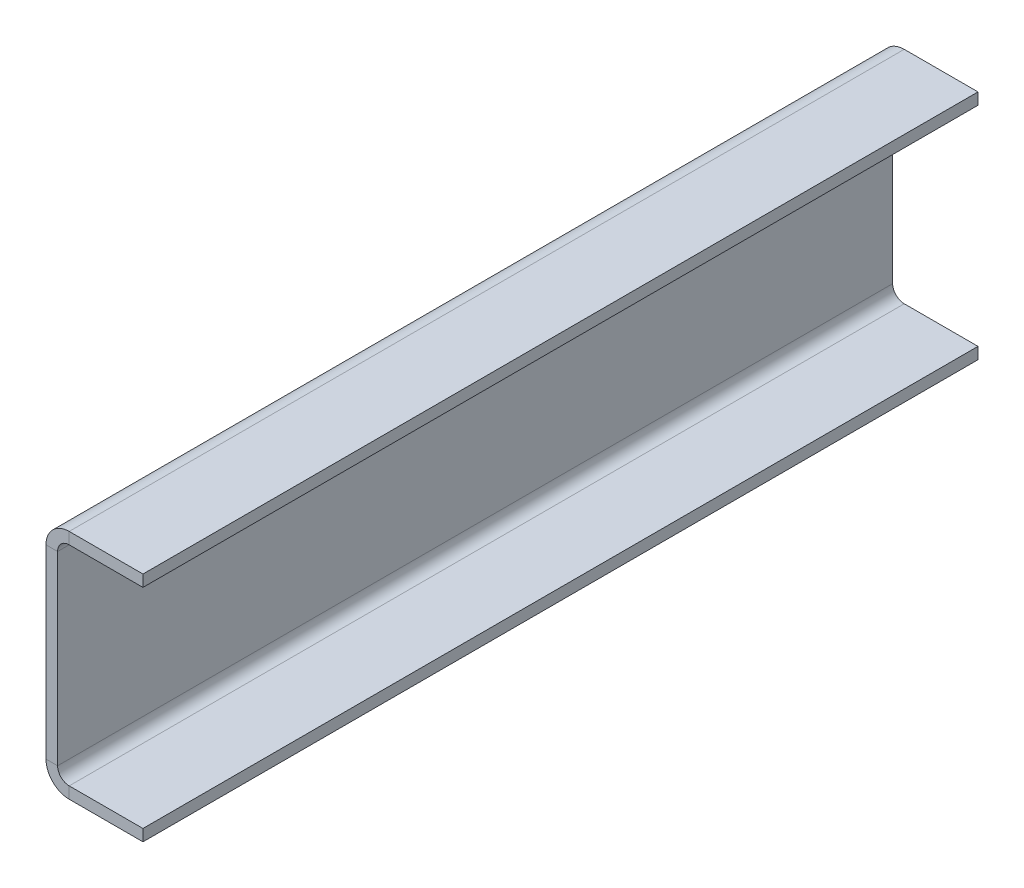
ISO-10303-21;
HEADER;
FILE_DESCRIPTION(('STEP AP214'),'2;1');
FILE_NAME('part.step','',(''),(''),'','','');
FILE_SCHEMA(('AUTOMOTIVE_DESIGN { 1 0 10303 214 1 1 1 1 }'));
ENDSEC;
DATA;
#1=APPLICATION_CONTEXT('core data for automotive mechanical design processes');
#2=APPLICATION_PROTOCOL_DEFINITION('international standard','automotive_design',2000,#1);
#3=PRODUCT_CONTEXT('',#1,'mechanical');
#4=PRODUCT('Part','Part','',(#3));
#5=PRODUCT_RELATED_PRODUCT_CATEGORY('part','',(#4));
#6=PRODUCT_DEFINITION_FORMATION('','',#4);
#7=PRODUCT_DEFINITION_CONTEXT('part definition',#1,'design');
#8=PRODUCT_DEFINITION('design','',#6,#7);
#9=PRODUCT_DEFINITION_SHAPE('','',#8);
#10=(LENGTH_UNIT() NAMED_UNIT(*) SI_UNIT(.MILLI.,.METRE.));
#11=(NAMED_UNIT(*) PLANE_ANGLE_UNIT() SI_UNIT($,.RADIAN.));
#12=(NAMED_UNIT(*) SI_UNIT($,.STERADIAN.) SOLID_ANGLE_UNIT());
#13=UNCERTAINTY_MEASURE_WITH_UNIT(LENGTH_MEASURE(1.E-05),#10,'distance_accuracy_value','');
#14=(GEOMETRIC_REPRESENTATION_CONTEXT(3) GLOBAL_UNCERTAINTY_ASSIGNED_CONTEXT((#13)) GLOBAL_UNIT_ASSIGNED_CONTEXT((#10,
#11,#12)) REPRESENTATION_CONTEXT('',''));
#15=CARTESIAN_POINT('',(0.,0.,0.));
#16=DIRECTION('',(0.,0.,1.));
#17=DIRECTION('',(1.,0.,0.));
#18=AXIS2_PLACEMENT_3D('',#15,#16,#17);
#19=CARTESIAN_POINT('',(-3.175,0.,0.));
#20=DIRECTION('',(-1.,0.,0.));
#21=DIRECTION('',(0.,0.,1.));
#22=AXIS2_PLACEMENT_3D('',#19,#20,#21);
#23=PLANE('',#22);
#24=DIRECTION('',(0.,1.,0.));
#25=VECTOR('',#24,1.);
#26=CARTESIAN_POINT('',(-3.175,0.,-228.6));
#27=LINE('',#26,#25);
#28=CARTESIAN_POINT('',(-3.17500000000002,6.35,-228.6));
#29=VERTEX_POINT('',#28);
#30=CARTESIAN_POINT('',(-3.175,57.15,-228.6));
#31=VERTEX_POINT('',#30);
#32=EDGE_CURVE('E13',#29,#31,#27,.T.);
#33=ORIENTED_EDGE('',*,*,#32,.F.);
#34=DIRECTION('',(0.,0.,-1.));
#35=VECTOR('',#34,1.);
#36=CARTESIAN_POINT('',(-3.17500000000002,6.35,-228.6));
#37=LINE('',#36,#35);
#38=CARTESIAN_POINT('',(-3.175,6.35000000000002,0.));
#39=VERTEX_POINT('',#38);
#40=EDGE_CURVE('E211',#29,#39,#37,.F.);
#41=ORIENTED_EDGE('',*,*,#40,.T.);
#42=DIRECTION('',(0.,-1.,0.));
#43=VECTOR('',#42,1.);
#44=CARTESIAN_POINT('',(-3.175,0.,0.));
#45=LINE('',#44,#43);
#46=CARTESIAN_POINT('',(-3.175,57.15,0.));
#47=VERTEX_POINT('',#46);
#48=EDGE_CURVE('E88',#47,#39,#45,.T.);
#49=ORIENTED_EDGE('',*,*,#48,.F.);
#50=DIRECTION('',(0.,0.,1.));
#51=VECTOR('',#50,1.);
#52=CARTESIAN_POINT('',(-3.175,57.15,0.));
#53=LINE('',#52,#51);
#54=EDGE_CURVE('E262',#47,#31,#53,.F.);
#55=ORIENTED_EDGE('',*,*,#54,.T.);
#56=EDGE_LOOP('',(#33,#41,#49,#55));
#57=FACE_BOUND('',#56,.T.);
#58=ADVANCED_FACE('F79',(#57),#23,.T.);
#59=CARTESIAN_POINT('',(0.,0.,0.));
#60=DIRECTION('',(-1.,0.,0.));
#61=DIRECTION('',(0.,0.,1.));
#62=AXIS2_PLACEMENT_3D('',#59,#60,#61);
#63=PLANE('',#62);
#64=DIRECTION('',(0.,0.,-1.));
#65=VECTOR('',#64,1.);
#66=CARTESIAN_POINT('',(0.,6.34999999999999,-228.6));
#67=LINE('',#66,#65);
#68=CARTESIAN_POINT('',(0.,6.34999999999999,-228.6));
#69=VERTEX_POINT('',#68);
#70=CARTESIAN_POINT('',(0.,6.35000000000002,0.));
#71=VERTEX_POINT('',#70);
#72=EDGE_CURVE('E222',#69,#71,#67,.F.);
#73=ORIENTED_EDGE('',*,*,#72,.F.);
#74=DIRECTION('',(0.,1.,0.));
#75=VECTOR('',#74,1.);
#76=CARTESIAN_POINT('',(0.,0.,-228.6));
#77=LINE('',#76,#75);
#78=CARTESIAN_POINT('',(0.,57.15,-228.6));
#79=VERTEX_POINT('',#78);
#80=EDGE_CURVE('E83',#69,#79,#77,.T.);
#81=ORIENTED_EDGE('',*,*,#80,.T.);
#82=DIRECTION('',(0.,0.,1.));
#83=VECTOR('',#82,1.);
#84=CARTESIAN_POINT('',(0.,57.15,0.));
#85=LINE('',#84,#83);
#86=CARTESIAN_POINT('',(0.,57.15,0.));
#87=VERTEX_POINT('',#86);
#88=EDGE_CURVE('E273',#87,#79,#85,.F.);
#89=ORIENTED_EDGE('',*,*,#88,.F.);
#90=DIRECTION('',(0.,-1.,0.));
#91=VECTOR('',#90,1.);
#92=CARTESIAN_POINT('',(0.,0.,0.));
#93=LINE('',#92,#91);
#94=EDGE_CURVE('E279',#87,#71,#93,.T.);
#95=ORIENTED_EDGE('',*,*,#94,.T.);
#96=EDGE_LOOP('',(#73,#81,#89,#95));
#97=FACE_BOUND('',#96,.T.);
#98=ADVANCED_FACE('F291',(#97),#63,.F.);
#99=CARTESIAN_POINT('',(-3.175,0.,-228.6));
#100=DIRECTION('',(0.,0.,-1.));
#101=DIRECTION('',(-1.,0.,0.));
#102=AXIS2_PLACEMENT_3D('',#99,#100,#101);
#103=PLANE('',#102);
#104=ORIENTED_EDGE('',*,*,#80,.F.);
#105=DIRECTION('',(-1.,0.,0.));
#106=VECTOR('',#105,1.);
#107=CARTESIAN_POINT('',(0.,6.34999999999999,-228.6));
#108=LINE('',#107,#106);
#109=EDGE_CURVE('E216',#69,#29,#108,.T.);
#110=ORIENTED_EDGE('',*,*,#109,.T.);
#111=ORIENTED_EDGE('',*,*,#32,.T.);
#112=DIRECTION('',(-1.,0.,0.));
#113=VECTOR('',#112,1.);
#114=CARTESIAN_POINT('',(0.,57.15,-228.6));
#115=LINE('',#114,#113);
#116=EDGE_CURVE('E277',#79,#31,#115,.T.);
#117=ORIENTED_EDGE('',*,*,#116,.F.);
#118=EDGE_LOOP('',(#104,#110,#111,#117));
#119=FACE_BOUND('',#118,.T.);
#120=ADVANCED_FACE('F293',(#119),#103,.T.);
#121=CARTESIAN_POINT('',(-3.175,0.,0.));
#122=DIRECTION('',(0.,0.,1.));
#123=DIRECTION('',(1.,0.,0.));
#124=AXIS2_PLACEMENT_3D('',#121,#122,#123);
#125=PLANE('',#124);
#126=DIRECTION('',(-1.,0.,0.));
#127=VECTOR('',#126,1.);
#128=CARTESIAN_POINT('',(0.,6.35000000000002,0.));
#129=LINE('',#128,#127);
#130=EDGE_CURVE('E227',#71,#39,#129,.T.);
#131=ORIENTED_EDGE('',*,*,#130,.F.);
#132=ORIENTED_EDGE('',*,*,#94,.F.);
#133=DIRECTION('',(-1.,0.,0.));
#134=VECTOR('',#133,1.);
#135=CARTESIAN_POINT('',(0.,57.15,0.));
#136=LINE('',#135,#134);
#137=EDGE_CURVE('E267',#87,#47,#136,.T.);
#138=ORIENTED_EDGE('',*,*,#137,.T.);
#139=ORIENTED_EDGE('',*,*,#48,.T.);
#140=EDGE_LOOP('',(#131,#132,#138,#139));
#141=FACE_BOUND('',#140,.T.);
#142=ADVANCED_FACE('F81',(#141),#125,.T.);
#143=CARTESIAN_POINT('',(3.175,57.15,-228.6));
#144=DIRECTION('',(0.,0.,-1.));
#145=DIRECTION('',(-1.,0.,0.));
#146=AXIS2_PLACEMENT_3D('',#143,#144,#145);
#147=PLANE('',#146);
#148=DIRECTION('',(0.,-1.,0.));
#149=VECTOR('',#148,1.);
#150=CARTESIAN_POINT('',(3.17499999999998,63.5,-228.6));
#151=LINE('',#150,#149);
#152=CARTESIAN_POINT('',(3.17499999999999,60.325,-228.6));
#153=VERTEX_POINT('',#152);
#154=CARTESIAN_POINT('',(3.17499999999998,63.5,-228.6));
#155=VERTEX_POINT('',#154);
#156=EDGE_CURVE('E229',#153,#155,#151,.F.);
#157=ORIENTED_EDGE('',*,*,#156,.F.);
#158=CARTESIAN_POINT('',(3.175,57.15,-228.6));
#159=DIRECTION('',(0.,0.,1.));
#160=DIRECTION('',(1.,0.,0.));
#161=AXIS2_PLACEMENT_3D('',#158,#159,#160);
#162=CIRCLE('',#161,3.175);
#163=EDGE_CURVE('E270',#79,#153,#162,.F.);
#164=ORIENTED_EDGE('',*,*,#163,.F.);
#165=ORIENTED_EDGE('',*,*,#116,.T.);
#166=CARTESIAN_POINT('',(3.175,57.15,-228.6));
#167=DIRECTION('',(0.,0.,1.));
#168=DIRECTION('',(1.,0.,0.));
#169=AXIS2_PLACEMENT_3D('',#166,#167,#168);
#170=CIRCLE('',#169,6.35);
#171=EDGE_CURVE('E96',#31,#155,#170,.F.);
#172=ORIENTED_EDGE('',*,*,#171,.T.);
#173=EDGE_LOOP('',(#157,#164,#165,#172));
#174=FACE_BOUND('',#173,.T.);
#175=ADVANCED_FACE('F297',(#174),#147,.T.);
#176=CARTESIAN_POINT('',(3.175,57.15,0.));
#177=DIRECTION('',(0.,0.,-1.));
#178=DIRECTION('',(-1.,0.,0.));
#179=AXIS2_PLACEMENT_3D('',#176,#177,#178);
#180=PLANE('',#179);
#181=CARTESIAN_POINT('',(3.175,57.15,0.));
#182=DIRECTION('',(0.,0.,1.));
#183=DIRECTION('',(1.,0.,0.));
#184=AXIS2_PLACEMENT_3D('',#181,#182,#183);
#185=CIRCLE('',#184,3.175);
#186=CARTESIAN_POINT('',(3.17499999999999,60.325,0.));
#187=VERTEX_POINT('',#186);
#188=EDGE_CURVE('E235',#187,#87,#185,.T.);
#189=ORIENTED_EDGE('',*,*,#188,.F.);
#190=DIRECTION('',(0.,-1.,0.));
#191=VECTOR('',#190,1.);
#192=CARTESIAN_POINT('',(3.17499999999999,60.325,0.));
#193=LINE('',#192,#191);
#194=CARTESIAN_POINT('',(3.17499999999998,63.5,0.));
#195=VERTEX_POINT('',#194);
#196=EDGE_CURVE('E255',#187,#195,#193,.F.);
#197=ORIENTED_EDGE('',*,*,#196,.T.);
#198=CARTESIAN_POINT('',(3.175,57.15,0.));
#199=DIRECTION('',(0.,0.,1.));
#200=DIRECTION('',(1.,0.,0.));
#201=AXIS2_PLACEMENT_3D('',#198,#199,#200);
#202=CIRCLE('',#201,6.35);
#203=EDGE_CURVE('E265',#195,#47,#202,.T.);
#204=ORIENTED_EDGE('',*,*,#203,.T.);
#205=ORIENTED_EDGE('',*,*,#137,.F.);
#206=EDGE_LOOP('',(#189,#197,#204,#205));
#207=FACE_BOUND('',#206,.T.);
#208=ADVANCED_FACE('F321',(#207),#180,.F.);
#209=CARTESIAN_POINT('',(3.175,57.15,0.));
#210=DIRECTION('',(0.,0.,1.));
#211=DIRECTION('',(0.,1.,0.));
#212=AXIS2_PLACEMENT_3D('',#209,#210,#211);
#213=CYLINDRICAL_SURFACE('',#212,6.35);
#214=ORIENTED_EDGE('',*,*,#54,.F.);
#215=ORIENTED_EDGE('',*,*,#203,.F.);
#216=DIRECTION('',(0.,0.,1.));
#217=VECTOR('',#216,1.);
#218=CARTESIAN_POINT('',(3.17499999999998,63.5,-228.6));
#219=LINE('',#218,#217);
#220=EDGE_CURVE('E253',#195,#155,#219,.F.);
#221=ORIENTED_EDGE('',*,*,#220,.T.);
#222=ORIENTED_EDGE('',*,*,#171,.F.);
#223=EDGE_LOOP('',(#214,#215,#221,#222));
#224=FACE_BOUND('',#223,.T.);
#225=ADVANCED_FACE('F324',(#224),#213,.T.);
#226=CARTESIAN_POINT('',(3.175,57.15,0.));
#227=DIRECTION('',(0.,0.,1.));
#228=DIRECTION('',(0.,1.,0.));
#229=AXIS2_PLACEMENT_3D('',#226,#227,#228);
#230=CYLINDRICAL_SURFACE('',#229,3.175);
#231=ORIENTED_EDGE('',*,*,#88,.T.);
#232=ORIENTED_EDGE('',*,*,#163,.T.);
#233=DIRECTION('',(0.,0.,1.));
#234=VECTOR('',#233,1.);
#235=CARTESIAN_POINT('',(3.17499999999999,60.325,-228.6));
#236=LINE('',#235,#234);
#237=EDGE_CURVE('E258',#153,#187,#236,.T.);
#238=ORIENTED_EDGE('',*,*,#237,.T.);
#239=ORIENTED_EDGE('',*,*,#188,.T.);
#240=EDGE_LOOP('',(#231,#232,#238,#239));
#241=FACE_BOUND('',#240,.T.);
#242=ADVANCED_FACE('F300',(#241),#230,.F.);
#243=CARTESIAN_POINT('',(23.368,63.5000000000001,0.));
#244=DIRECTION('',(0.,0.,-1.));
#245=DIRECTION('',(-1.,0.,0.));
#246=AXIS2_PLACEMENT_3D('',#243,#244,#245);
#247=PLANE('',#246);
#248=ORIENTED_EDGE('',*,*,#196,.F.);
#249=DIRECTION('',(-1.,0.,0.));
#250=VECTOR('',#249,1.);
#251=CARTESIAN_POINT('',(23.368,60.3250000000001,0.));
#252=LINE('',#251,#250);
#253=CARTESIAN_POINT('',(23.368,60.3250000000001,0.));
#254=VERTEX_POINT('',#253);
#255=EDGE_CURVE('E251',#187,#254,#252,.F.);
#256=ORIENTED_EDGE('',*,*,#255,.T.);
#257=DIRECTION('',(0.,-1.,0.));
#258=VECTOR('',#257,1.);
#259=CARTESIAN_POINT('',(23.368,63.5000000000001,0.));
#260=LINE('',#259,#258);
#261=CARTESIAN_POINT('',(23.368,63.5000000000001,0.));
#262=VERTEX_POINT('',#261);
#263=EDGE_CURVE('E232',#262,#254,#260,.T.);
#264=ORIENTED_EDGE('',*,*,#263,.F.);
#265=DIRECTION('',(1.,0.,0.));
#266=VECTOR('',#265,1.);
#267=CARTESIAN_POINT('',(-2.37353732726063E-13,63.5,0.));
#268=LINE('',#267,#266);
#269=EDGE_CURVE('E244',#195,#262,#268,.T.);
#270=ORIENTED_EDGE('',*,*,#269,.F.);
#271=EDGE_LOOP('',(#248,#256,#264,#270));
#272=FACE_BOUND('',#271,.T.);
#273=ADVANCED_FACE('F318',(#272),#247,.F.);
#274=CARTESIAN_POINT('',(0.,63.5,-228.6));
#275=DIRECTION('',(0.,0.,1.));
#276=DIRECTION('',(1.,0.,0.));
#277=AXIS2_PLACEMENT_3D('',#274,#275,#276);
#278=PLANE('',#277);
#279=ORIENTED_EDGE('',*,*,#156,.T.);
#280=DIRECTION('',(-1.,0.,0.));
#281=VECTOR('',#280,1.);
#282=CARTESIAN_POINT('',(-2.37353732726063E-13,63.5,-228.6));
#283=LINE('',#282,#281);
#284=CARTESIAN_POINT('',(23.368,63.5000000000001,-228.6));
#285=VERTEX_POINT('',#284);
#286=EDGE_CURVE('E239',#285,#155,#283,.T.);
#287=ORIENTED_EDGE('',*,*,#286,.F.);
#288=DIRECTION('',(0.,-1.,0.));
#289=VECTOR('',#288,1.);
#290=CARTESIAN_POINT('',(23.368,63.5000000000001,-228.6));
#291=LINE('',#290,#289);
#292=CARTESIAN_POINT('',(23.368,60.3250000000001,-228.6));
#293=VERTEX_POINT('',#292);
#294=EDGE_CURVE('E236',#285,#293,#291,.T.);
#295=ORIENTED_EDGE('',*,*,#294,.T.);
#296=DIRECTION('',(1.,0.,0.));
#297=VECTOR('',#296,1.);
#298=CARTESIAN_POINT('',(0.,60.325,-228.6));
#299=LINE('',#298,#297);
#300=EDGE_CURVE('E246',#293,#153,#299,.F.);
#301=ORIENTED_EDGE('',*,*,#300,.T.);
#302=EDGE_LOOP('',(#279,#287,#295,#301));
#303=FACE_BOUND('',#302,.T.);
#304=ADVANCED_FACE('F308',(#303),#278,.F.);
#305=CARTESIAN_POINT('',(-2.37353732726063E-13,63.5,0.));
#306=DIRECTION('',(0.,-1.,0.));
#307=DIRECTION('',(1.,0.,0.));
#308=AXIS2_PLACEMENT_3D('',#305,#306,#307);
#309=PLANE('',#308);
#310=ORIENTED_EDGE('',*,*,#220,.F.);
#311=ORIENTED_EDGE('',*,*,#269,.T.);
#312=DIRECTION('',(0.,0.,-1.));
#313=VECTOR('',#312,1.);
#314=CARTESIAN_POINT('',(23.368,63.5000000000001,0.));
#315=LINE('',#314,#313);
#316=EDGE_CURVE('E242',#262,#285,#315,.T.);
#317=ORIENTED_EDGE('',*,*,#316,.T.);
#318=ORIENTED_EDGE('',*,*,#286,.T.);
#319=EDGE_LOOP('',(#310,#311,#317,#318));
#320=FACE_BOUND('',#319,.T.);
#321=ADVANCED_FACE('F323',(#320),#309,.F.);
#322=CARTESIAN_POINT('',(-2.26268279475236E-13,60.325,0.));
#323=DIRECTION('',(0.,-1.,0.));
#324=DIRECTION('',(1.,0.,0.));
#325=AXIS2_PLACEMENT_3D('',#322,#323,#324);
#326=PLANE('',#325);
#327=ORIENTED_EDGE('',*,*,#255,.F.);
#328=ORIENTED_EDGE('',*,*,#237,.F.);
#329=ORIENTED_EDGE('',*,*,#300,.F.);
#330=DIRECTION('',(0.,0.,1.));
#331=VECTOR('',#330,1.);
#332=CARTESIAN_POINT('',(23.368,60.3250000000001,-228.6));
#333=LINE('',#332,#331);
#334=EDGE_CURVE('E249',#254,#293,#333,.F.);
#335=ORIENTED_EDGE('',*,*,#334,.F.);
#336=EDGE_LOOP('',(#327,#328,#329,#335));
#337=FACE_BOUND('',#336,.T.);
#338=ADVANCED_FACE('F305',(#337),#326,.T.);
#339=CARTESIAN_POINT('',(23.368,63.5000000000001,-228.6));
#340=DIRECTION('',(-1.,0.,0.));
#341=DIRECTION('',(0.,-1.,0.));
#342=AXIS2_PLACEMENT_3D('',#339,#340,#341);
#343=PLANE('',#342);
#344=ORIENTED_EDGE('',*,*,#334,.T.);
#345=ORIENTED_EDGE('',*,*,#294,.F.);
#346=ORIENTED_EDGE('',*,*,#316,.F.);
#347=ORIENTED_EDGE('',*,*,#263,.T.);
#348=EDGE_LOOP('',(#344,#345,#346,#347));
#349=FACE_BOUND('',#348,.T.);
#350=ADVANCED_FACE('F313',(#349),#343,.F.);
#351=CARTESIAN_POINT('',(3.175,6.35,0.));
#352=DIRECTION('',(0.,0.,1.));
#353=DIRECTION('',(0.,-1.,0.));
#354=AXIS2_PLACEMENT_3D('',#351,#352,#353);
#355=PLANE('',#354);
#356=DIRECTION('',(0.,1.,0.));
#357=VECTOR('',#356,1.);
#358=CARTESIAN_POINT('',(3.17499999999998,0.,0.));
#359=LINE('',#358,#357);
#360=CARTESIAN_POINT('',(3.17499999999999,3.17499999999999,0.));
#361=VERTEX_POINT('',#360);
#362=CARTESIAN_POINT('',(3.17499999999998,0.,0.));
#363=VERTEX_POINT('',#362);
#364=EDGE_CURVE('E194',#361,#363,#359,.F.);
#365=ORIENTED_EDGE('',*,*,#364,.F.);
#366=CARTESIAN_POINT('',(3.175,6.35,0.));
#367=DIRECTION('',(0.,0.,-1.));
#368=DIRECTION('',(0.,1.,0.));
#369=AXIS2_PLACEMENT_3D('',#366,#367,#368);
#370=CIRCLE('',#369,3.17500000000002);
#371=EDGE_CURVE('E219',#71,#361,#370,.F.);
#372=ORIENTED_EDGE('',*,*,#371,.F.);
#373=ORIENTED_EDGE('',*,*,#130,.T.);
#374=CARTESIAN_POINT('',(3.175,6.35,0.));
#375=DIRECTION('',(0.,0.,-1.));
#376=DIRECTION('',(0.,1.,0.));
#377=AXIS2_PLACEMENT_3D('',#374,#375,#376);
#378=CIRCLE('',#377,6.35000000000002);
#379=EDGE_CURVE('E104',#39,#363,#378,.F.);
#380=ORIENTED_EDGE('',*,*,#379,.T.);
#381=EDGE_LOOP('',(#365,#372,#373,#380));
#382=FACE_BOUND('',#381,.T.);
#383=ADVANCED_FACE('F331',(#382),#355,.T.);
#384=CARTESIAN_POINT('',(3.175,6.34999999999997,-228.6));
#385=DIRECTION('',(0.,0.,1.));
#386=DIRECTION('',(0.,-1.,0.));
#387=AXIS2_PLACEMENT_3D('',#384,#385,#386);
#388=PLANE('',#387);
#389=CARTESIAN_POINT('',(3.175,6.34999999999997,-228.6));
#390=DIRECTION('',(0.,0.,-1.));
#391=DIRECTION('',(0.,1.,0.));
#392=AXIS2_PLACEMENT_3D('',#389,#390,#391);
#393=CIRCLE('',#392,3.17500000000002);
#394=CARTESIAN_POINT('',(3.17499999999999,3.17499999999996,-228.6));
#395=VERTEX_POINT('',#394);
#396=EDGE_CURVE('E224',#395,#69,#393,.T.);
#397=ORIENTED_EDGE('',*,*,#396,.F.);
#398=DIRECTION('',(0.,1.,0.));
#399=VECTOR('',#398,1.);
#400=CARTESIAN_POINT('',(3.17499999999999,3.17499999999999,-228.6));
#401=LINE('',#400,#399);
#402=CARTESIAN_POINT('',(3.17499999999998,0.,-228.6));
#403=VERTEX_POINT('',#402);
#404=EDGE_CURVE('E205',#395,#403,#401,.F.);
#405=ORIENTED_EDGE('',*,*,#404,.T.);
#406=CARTESIAN_POINT('',(3.175,6.34999999999997,-228.6));
#407=DIRECTION('',(0.,0.,-1.));
#408=DIRECTION('',(0.,1.,0.));
#409=AXIS2_PLACEMENT_3D('',#406,#407,#408);
#410=CIRCLE('',#409,6.35000000000002);
#411=EDGE_CURVE('E214',#403,#29,#410,.T.);
#412=ORIENTED_EDGE('',*,*,#411,.T.);
#413=ORIENTED_EDGE('',*,*,#109,.F.);
#414=EDGE_LOOP('',(#397,#405,#412,#413));
#415=FACE_BOUND('',#414,.T.);
#416=ADVANCED_FACE('F344',(#415),#388,.F.);
#417=CARTESIAN_POINT('',(3.175,6.34999999999997,-228.6));
#418=DIRECTION('',(0.,0.,-1.));
#419=DIRECTION('',(0.,-1.,0.));
#420=AXIS2_PLACEMENT_3D('',#417,#418,#419);
#421=CYLINDRICAL_SURFACE('',#420,6.35000000000002);
#422=ORIENTED_EDGE('',*,*,#40,.F.);
#423=ORIENTED_EDGE('',*,*,#411,.F.);
#424=DIRECTION('',(0.,0.,-1.));
#425=VECTOR('',#424,1.);
#426=CARTESIAN_POINT('',(3.17499999999998,0.,0.));
#427=LINE('',#426,#425);
#428=EDGE_CURVE('E203',#403,#363,#427,.F.);
#429=ORIENTED_EDGE('',*,*,#428,.T.);
#430=ORIENTED_EDGE('',*,*,#379,.F.);
#431=EDGE_LOOP('',(#422,#423,#429,#430));
#432=FACE_BOUND('',#431,.T.);
#433=ADVANCED_FACE('F345',(#432),#421,.T.);
#434=CARTESIAN_POINT('',(3.175,6.34999999999997,-228.6));
#435=DIRECTION('',(0.,0.,-1.));
#436=DIRECTION('',(0.,-1.,0.));
#437=AXIS2_PLACEMENT_3D('',#434,#435,#436);
#438=CYLINDRICAL_SURFACE('',#437,3.17500000000002);
#439=ORIENTED_EDGE('',*,*,#72,.T.);
#440=ORIENTED_EDGE('',*,*,#371,.T.);
#441=DIRECTION('',(0.,0.,-1.));
#442=VECTOR('',#441,1.);
#443=CARTESIAN_POINT('',(3.17499999999999,3.17499999999999,0.));
#444=LINE('',#443,#442);
#445=EDGE_CURVE('E208',#361,#395,#444,.T.);
#446=ORIENTED_EDGE('',*,*,#445,.T.);
#447=ORIENTED_EDGE('',*,*,#396,.T.);
#448=EDGE_LOOP('',(#439,#440,#446,#447));
#449=FACE_BOUND('',#448,.T.);
#450=ADVANCED_FACE('F334',(#449),#438,.F.);
#451=CARTESIAN_POINT('',(0.,0.,0.));
#452=DIRECTION('',(0.,0.,-1.));
#453=DIRECTION('',(-1.,0.,0.));
#454=AXIS2_PLACEMENT_3D('',#451,#452,#453);
#455=PLANE('',#454);
#456=ORIENTED_EDGE('',*,*,#364,.T.);
#457=DIRECTION('',(-1.,0.,0.));
#458=VECTOR('',#457,1.);
#459=CARTESIAN_POINT('',(0.,0.,0.));
#460=LINE('',#459,#458);
#461=CARTESIAN_POINT('',(23.368,0.,0.));
#462=VERTEX_POINT('',#461);
#463=EDGE_CURVE('E175',#462,#363,#460,.T.);
#464=ORIENTED_EDGE('',*,*,#463,.F.);
#465=DIRECTION('',(0.,1.,0.));
#466=VECTOR('',#465,1.);
#467=CARTESIAN_POINT('',(23.368,0.,0.));
#468=LINE('',#467,#466);
#469=CARTESIAN_POINT('',(23.368,3.17499999999992,0.));
#470=VERTEX_POINT('',#469);
#471=EDGE_CURVE('E181',#462,#470,#468,.T.);
#472=ORIENTED_EDGE('',*,*,#471,.T.);
#473=DIRECTION('',(1.,0.,0.));
#474=VECTOR('',#473,1.);
#475=CARTESIAN_POINT('',(0.,3.175,0.));
#476=LINE('',#475,#474);
#477=EDGE_CURVE('E201',#470,#361,#476,.F.);
#478=ORIENTED_EDGE('',*,*,#477,.T.);
#479=EDGE_LOOP('',(#456,#464,#472,#478));
#480=FACE_BOUND('',#479,.T.);
#481=ADVANCED_FACE('F193',(#480),#455,.F.);
#482=CARTESIAN_POINT('',(23.368,0.,-228.6));
#483=DIRECTION('',(0.,0.,1.));
#484=DIRECTION('',(1.,0.,0.));
#485=AXIS2_PLACEMENT_3D('',#482,#483,#484);
#486=PLANE('',#485);
#487=ORIENTED_EDGE('',*,*,#404,.F.);
#488=DIRECTION('',(-1.,0.,0.));
#489=VECTOR('',#488,1.);
#490=CARTESIAN_POINT('',(23.368,3.17499999999992,-228.6));
#491=LINE('',#490,#489);
#492=CARTESIAN_POINT('',(23.368,3.17499999999992,-228.6));
#493=VERTEX_POINT('',#492);
#494=EDGE_CURVE('E197',#395,#493,#491,.F.);
#495=ORIENTED_EDGE('',*,*,#494,.T.);
#496=DIRECTION('',(0.,1.,0.));
#497=VECTOR('',#496,1.);
#498=CARTESIAN_POINT('',(23.368,0.,-228.6));
#499=LINE('',#498,#497);
#500=CARTESIAN_POINT('',(23.368,0.,-228.6));
#501=VERTEX_POINT('',#500);
#502=EDGE_CURVE('E190',#501,#493,#499,.T.);
#503=ORIENTED_EDGE('',*,*,#502,.F.);
#504=DIRECTION('',(1.,0.,0.));
#505=VECTOR('',#504,1.);
#506=CARTESIAN_POINT('',(0.,0.,-228.6));
#507=LINE('',#506,#505);
#508=EDGE_CURVE('E177',#403,#501,#507,.T.);
#509=ORIENTED_EDGE('',*,*,#508,.F.);
#510=EDGE_LOOP('',(#487,#495,#503,#509));
#511=FACE_BOUND('',#510,.T.);
#512=ADVANCED_FACE('F341',(#511),#486,.F.);
#513=CARTESIAN_POINT('',(0.,0.,0.));
#514=DIRECTION('',(0.,1.,0.));
#515=DIRECTION('',(-1.,0.,0.));
#516=AXIS2_PLACEMENT_3D('',#513,#514,#515);
#517=PLANE('',#516);
#518=ORIENTED_EDGE('',*,*,#428,.F.);
#519=ORIENTED_EDGE('',*,*,#508,.T.);
#520=DIRECTION('',(0.,0.,1.));
#521=VECTOR('',#520,1.);
#522=CARTESIAN_POINT('',(23.368,0.,0.));
#523=LINE('',#522,#521);
#524=EDGE_CURVE('E170',#501,#462,#523,.T.);
#525=ORIENTED_EDGE('',*,*,#524,.T.);
#526=ORIENTED_EDGE('',*,*,#463,.T.);
#527=EDGE_LOOP('',(#518,#519,#525,#526));
#528=FACE_BOUND('',#527,.T.);
#529=ADVANCED_FACE('F173',(#528),#517,.F.);
#530=CARTESIAN_POINT('',(0.,3.175,0.));
#531=DIRECTION('',(0.,1.,0.));
#532=DIRECTION('',(-1.,0.,0.));
#533=AXIS2_PLACEMENT_3D('',#530,#531,#532);
#534=PLANE('',#533);
#535=ORIENTED_EDGE('',*,*,#494,.F.);
#536=ORIENTED_EDGE('',*,*,#445,.F.);
#537=ORIENTED_EDGE('',*,*,#477,.F.);
#538=DIRECTION('',(0.,0.,-1.));
#539=VECTOR('',#538,1.);
#540=CARTESIAN_POINT('',(23.368,3.17499999999992,0.));
#541=LINE('',#540,#539);
#542=EDGE_CURVE('E186',#493,#470,#541,.F.);
#543=ORIENTED_EDGE('',*,*,#542,.F.);
#544=EDGE_LOOP('',(#535,#536,#537,#543));
#545=FACE_BOUND('',#544,.T.);
#546=ADVANCED_FACE('F338',(#545),#534,.T.);
#547=CARTESIAN_POINT('',(23.368,0.,0.));
#548=DIRECTION('',(-1.,0.,0.));
#549=DIRECTION('',(0.,-1.,0.));
#550=AXIS2_PLACEMENT_3D('',#547,#548,#549);
#551=PLANE('',#550);
#552=ORIENTED_EDGE('',*,*,#542,.T.);
#553=ORIENTED_EDGE('',*,*,#471,.F.);
#554=ORIENTED_EDGE('',*,*,#524,.F.);
#555=ORIENTED_EDGE('',*,*,#502,.T.);
#556=EDGE_LOOP('',(#552,#553,#554,#555));
#557=FACE_BOUND('',#556,.T.);
#558=ADVANCED_FACE('F184',(#557),#551,.F.);
#559=CLOSED_SHELL('',(#58,#98,#120,#142,#175,#208,#225,#242,#273,#304,#321,#338,#350,#383,#416,
#433,#450,#481,#512,#529,#546,#558));
#560=MANIFOLD_SOLID_BREP('B2',#559);
#561=ADVANCED_BREP_SHAPE_REPRESENTATION('',(#18,#560),#14);
#562=SHAPE_DEFINITION_REPRESENTATION(#9,#561);
ENDSEC;
END-ISO-10303-21;
